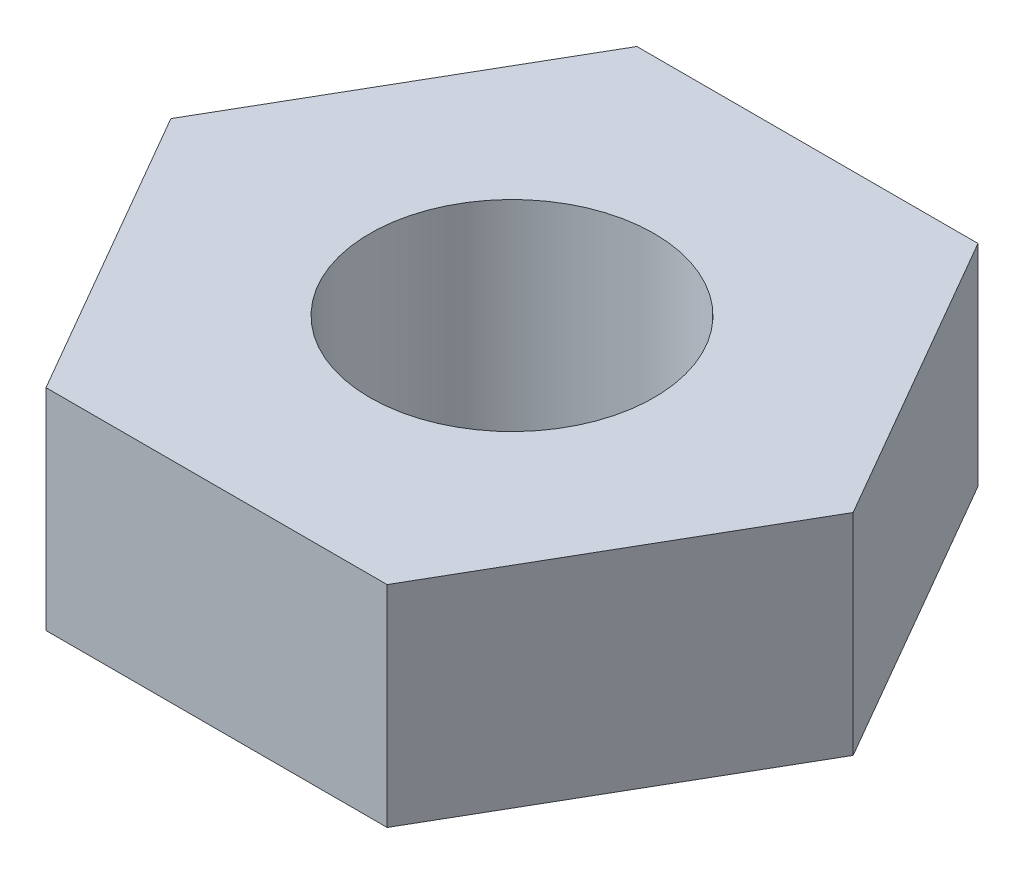
ISO-10303-21;
HEADER;
FILE_DESCRIPTION(('STEP AP214'),'2;1');
FILE_NAME('part.step','',(''),(''),'','','');
FILE_SCHEMA(('AUTOMOTIVE_DESIGN { 1 0 10303 214 1 1 1 1 }'));
ENDSEC;
DATA;
#1=APPLICATION_CONTEXT('core data for automotive mechanical design processes');
#2=APPLICATION_PROTOCOL_DEFINITION('international standard','automotive_design',2000,#1);
#3=PRODUCT_CONTEXT('',#1,'mechanical');
#4=PRODUCT('Part','Part','',(#3));
#5=PRODUCT_RELATED_PRODUCT_CATEGORY('part','',(#4));
#6=PRODUCT_DEFINITION_FORMATION('','',#4);
#7=PRODUCT_DEFINITION_CONTEXT('part definition',#1,'design');
#8=PRODUCT_DEFINITION('design','',#6,#7);
#9=PRODUCT_DEFINITION_SHAPE('','',#8);
#10=(LENGTH_UNIT() NAMED_UNIT(*) SI_UNIT(.MILLI.,.METRE.));
#11=(NAMED_UNIT(*) PLANE_ANGLE_UNIT() SI_UNIT($,.RADIAN.));
#12=(NAMED_UNIT(*) SI_UNIT($,.STERADIAN.) SOLID_ANGLE_UNIT());
#13=UNCERTAINTY_MEASURE_WITH_UNIT(LENGTH_MEASURE(1.E-05),#10,'distance_accuracy_value','');
#14=(GEOMETRIC_REPRESENTATION_CONTEXT(3) GLOBAL_UNCERTAINTY_ASSIGNED_CONTEXT((#13)) GLOBAL_UNIT_ASSIGNED_CONTEXT((#10,
#11,#12)) REPRESENTATION_CONTEXT('',''));
#15=CARTESIAN_POINT('',(0.,0.,0.));
#16=DIRECTION('',(0.,0.,1.));
#17=DIRECTION('',(1.,0.,0.));
#18=AXIS2_PLACEMENT_3D('',#15,#16,#17);
#19=CARTESIAN_POINT('',(1.50000000000003,1.85,2.59807621135329));
#20=DIRECTION('',(-0.866025403784442,0.,-0.499999999999995));
#21=DIRECTION('',(-0.499999999999995,0.,0.866025403784442));
#22=AXIS2_PLACEMENT_3D('',#19,#20,#21);
#23=PLANE('',#22);
#24=DIRECTION('',(0.499999999999995,0.,-0.866025403784442));
#25=VECTOR('',#24,1.);
#26=CARTESIAN_POINT('',(1.50000000000003,0.,2.59807621135329));
#27=LINE('',#26,#25);
#28=CARTESIAN_POINT('',(1.50000000000003,0.,2.59807621135329));
#29=VERTEX_POINT('',#28);
#30=CARTESIAN_POINT('',(2.99999999999999,0.,0.));
#31=VERTEX_POINT('',#30);
#32=EDGE_CURVE('E118',#29,#31,#27,.T.);
#33=ORIENTED_EDGE('',*,*,#32,.T.);
#34=DIRECTION('',(0.,-1.,0.));
#35=VECTOR('',#34,1.);
#36=CARTESIAN_POINT('',(2.99999999999999,1.85,0.));
#37=LINE('',#36,#35);
#38=CARTESIAN_POINT('',(2.99999999999999,1.85,0.));
#39=VERTEX_POINT('',#38);
#40=EDGE_CURVE('E11',#39,#31,#37,.T.);
#41=ORIENTED_EDGE('',*,*,#40,.F.);
#42=DIRECTION('',(0.499999999999995,0.,-0.866025403784442));
#43=VECTOR('',#42,1.);
#44=CARTESIAN_POINT('',(1.50000000000003,1.85,2.59807621135329));
#45=LINE('',#44,#43);
#46=CARTESIAN_POINT('',(1.50000000000003,1.85,2.59807621135329));
#47=VERTEX_POINT('',#46);
#48=EDGE_CURVE('E129',#47,#39,#45,.T.);
#49=ORIENTED_EDGE('',*,*,#48,.F.);
#50=DIRECTION('',(0.,-1.,0.));
#51=VECTOR('',#50,1.);
#52=CARTESIAN_POINT('',(1.50000000000003,1.85,2.59807621135329));
#53=LINE('',#52,#51);
#54=EDGE_CURVE('E114',#47,#29,#53,.T.);
#55=ORIENTED_EDGE('',*,*,#54,.T.);
#56=EDGE_LOOP('',(#33,#41,#49,#55));
#57=FACE_BOUND('',#56,.T.);
#58=ADVANCED_FACE('F34',(#57),#23,.F.);
#59=CARTESIAN_POINT('',(2.99999999999999,1.85,0.));
#60=DIRECTION('',(-0.866025403784438,0.,0.500000000000001));
#61=DIRECTION('',(0.500000000000001,0.,0.866025403784438));
#62=AXIS2_PLACEMENT_3D('',#59,#60,#61);
#63=PLANE('',#62);
#64=DIRECTION('',(-0.500000000000001,0.,-0.866025403784438));
#65=VECTOR('',#64,1.);
#66=CARTESIAN_POINT('',(2.99999999999999,0.,0.));
#67=LINE('',#66,#65);
#68=CARTESIAN_POINT('',(1.49999999999999,0.,-2.59807621135331));
#69=VERTEX_POINT('',#68);
#70=EDGE_CURVE('E121',#31,#69,#67,.T.);
#71=ORIENTED_EDGE('',*,*,#70,.T.);
#72=DIRECTION('',(0.,-1.,0.));
#73=VECTOR('',#72,1.);
#74=CARTESIAN_POINT('',(1.49999999999999,1.85,-2.59807621135331));
#75=LINE('',#74,#73);
#76=CARTESIAN_POINT('',(1.49999999999999,1.85,-2.59807621135331));
#77=VERTEX_POINT('',#76);
#78=EDGE_CURVE('E42',#77,#69,#75,.T.);
#79=ORIENTED_EDGE('',*,*,#78,.F.);
#80=DIRECTION('',(-0.500000000000001,0.,-0.866025403784438));
#81=VECTOR('',#80,1.);
#82=CARTESIAN_POINT('',(2.99999999999999,1.85,0.));
#83=LINE('',#82,#81);
#84=EDGE_CURVE('E87',#39,#77,#83,.T.);
#85=ORIENTED_EDGE('',*,*,#84,.F.);
#86=ORIENTED_EDGE('',*,*,#40,.T.);
#87=EDGE_LOOP('',(#71,#79,#85,#86));
#88=FACE_BOUND('',#87,.T.);
#89=ADVANCED_FACE('F154',(#88),#63,.F.);
#90=CARTESIAN_POINT('',(1.49999999999999,1.85,-2.59807621135331));
#91=DIRECTION('',(0.,0.,1.));
#92=DIRECTION('',(1.,0.,0.));
#93=AXIS2_PLACEMENT_3D('',#90,#91,#92);
#94=PLANE('',#93);
#95=DIRECTION('',(-1.,0.,0.));
#96=VECTOR('',#95,1.);
#97=CARTESIAN_POINT('',(1.49999999999999,0.,-2.59807621135331));
#98=LINE('',#97,#96);
#99=CARTESIAN_POINT('',(-1.50000000000001,0.,-2.5980762113533));
#100=VERTEX_POINT('',#99);
#101=EDGE_CURVE('E124',#69,#100,#98,.T.);
#102=ORIENTED_EDGE('',*,*,#101,.T.);
#103=DIRECTION('',(0.,-1.,0.));
#104=VECTOR('',#103,1.);
#105=CARTESIAN_POINT('',(-1.50000000000001,1.85,-2.5980762113533));
#106=LINE('',#105,#104);
#107=CARTESIAN_POINT('',(-1.50000000000001,1.85,-2.5980762113533));
#108=VERTEX_POINT('',#107);
#109=EDGE_CURVE('E109',#108,#100,#106,.T.);
#110=ORIENTED_EDGE('',*,*,#109,.F.);
#111=DIRECTION('',(-1.,0.,0.));
#112=VECTOR('',#111,1.);
#113=CARTESIAN_POINT('',(1.49999999999999,1.85,-2.59807621135331));
#114=LINE('',#113,#112);
#115=EDGE_CURVE('E100',#77,#108,#114,.T.);
#116=ORIENTED_EDGE('',*,*,#115,.F.);
#117=ORIENTED_EDGE('',*,*,#78,.T.);
#118=EDGE_LOOP('',(#102,#110,#116,#117));
#119=FACE_BOUND('',#118,.T.);
#120=ADVANCED_FACE('F135',(#119),#94,.F.);
#121=CARTESIAN_POINT('',(-1.50000000000001,1.85,-2.5980762113533));
#122=DIRECTION('',(0.866025403784442,0.,0.499999999999995));
#123=DIRECTION('',(0.499999999999995,0.,-0.866025403784442));
#124=AXIS2_PLACEMENT_3D('',#121,#122,#123);
#125=PLANE('',#124);
#126=DIRECTION('',(-0.499999999999995,0.,0.866025403784441));
#127=VECTOR('',#126,1.);
#128=CARTESIAN_POINT('',(-1.50000000000001,0.,-2.5980762113533));
#129=LINE('',#128,#127);
#130=CARTESIAN_POINT('',(-2.99999999999999,0.,0.));
#131=VERTEX_POINT('',#130);
#132=EDGE_CURVE('E108',#100,#131,#129,.T.);
#133=ORIENTED_EDGE('',*,*,#132,.T.);
#134=DIRECTION('',(0.,-1.,0.));
#135=VECTOR('',#134,1.);
#136=CARTESIAN_POINT('',(-2.99999999999999,1.85,0.));
#137=LINE('',#136,#135);
#138=CARTESIAN_POINT('',(-2.99999999999999,1.85,0.));
#139=VERTEX_POINT('',#138);
#140=EDGE_CURVE('E105',#139,#131,#137,.T.);
#141=ORIENTED_EDGE('',*,*,#140,.F.);
#142=DIRECTION('',(-0.499999999999995,0.,0.866025403784441));
#143=VECTOR('',#142,1.);
#144=CARTESIAN_POINT('',(-1.50000000000001,1.85,-2.5980762113533));
#145=LINE('',#144,#143);
#146=EDGE_CURVE('E94',#108,#139,#145,.T.);
#147=ORIENTED_EDGE('',*,*,#146,.F.);
#148=ORIENTED_EDGE('',*,*,#109,.T.);
#149=EDGE_LOOP('',(#133,#141,#147,#148));
#150=FACE_BOUND('',#149,.T.);
#151=ADVANCED_FACE('F106',(#150),#125,.F.);
#152=CARTESIAN_POINT('',(-2.99999999999999,1.85,0.));
#153=DIRECTION('',(0.866025403784435,0.,-0.500000000000007));
#154=DIRECTION('',(-0.500000000000007,0.,-0.866025403784435));
#155=AXIS2_PLACEMENT_3D('',#152,#153,#154);
#156=PLANE('',#155);
#157=DIRECTION('',(0.500000000000007,0.,0.866025403784435));
#158=VECTOR('',#157,1.);
#159=CARTESIAN_POINT('',(-2.99999999999999,0.,0.));
#160=LINE('',#159,#158);
#161=CARTESIAN_POINT('',(-1.49999999999997,0.,2.59807621135332));
#162=VERTEX_POINT('',#161);
#163=EDGE_CURVE('E73',#131,#162,#160,.T.);
#164=ORIENTED_EDGE('',*,*,#163,.T.);
#165=DIRECTION('',(0.,-1.,0.));
#166=VECTOR('',#165,1.);
#167=CARTESIAN_POINT('',(-1.49999999999997,1.85,2.59807621135332));
#168=LINE('',#167,#166);
#169=CARTESIAN_POINT('',(-1.49999999999997,1.85,2.59807621135332));
#170=VERTEX_POINT('',#169);
#171=EDGE_CURVE('E110',#170,#162,#168,.T.);
#172=ORIENTED_EDGE('',*,*,#171,.F.);
#173=DIRECTION('',(0.500000000000007,0.,0.866025403784435));
#174=VECTOR('',#173,1.);
#175=CARTESIAN_POINT('',(-2.99999999999999,1.85,0.));
#176=LINE('',#175,#174);
#177=EDGE_CURVE('E98',#139,#170,#176,.T.);
#178=ORIENTED_EDGE('',*,*,#177,.F.);
#179=ORIENTED_EDGE('',*,*,#140,.T.);
#180=EDGE_LOOP('',(#164,#172,#178,#179));
#181=FACE_BOUND('',#180,.T.);
#182=ADVANCED_FACE('F112',(#181),#156,.F.);
#183=CARTESIAN_POINT('',(-1.49999999999997,1.85,2.59807621135332));
#184=DIRECTION('',(0.,0.,-1.));
#185=DIRECTION('',(-1.,0.,0.));
#186=AXIS2_PLACEMENT_3D('',#183,#184,#185);
#187=PLANE('',#186);
#188=DIRECTION('',(1.,0.,0.));
#189=VECTOR('',#188,1.);
#190=CARTESIAN_POINT('',(-1.49999999999997,0.,2.59807621135332));
#191=LINE('',#190,#189);
#192=EDGE_CURVE('E79',#162,#29,#191,.T.);
#193=ORIENTED_EDGE('',*,*,#192,.T.);
#194=ORIENTED_EDGE('',*,*,#54,.F.);
#195=DIRECTION('',(1.,0.,0.));
#196=VECTOR('',#195,1.);
#197=CARTESIAN_POINT('',(-1.49999999999997,1.85,2.59807621135332));
#198=LINE('',#197,#196);
#199=EDGE_CURVE('E50',#170,#47,#198,.T.);
#200=ORIENTED_EDGE('',*,*,#199,.F.);
#201=ORIENTED_EDGE('',*,*,#171,.T.);
#202=EDGE_LOOP('',(#193,#194,#200,#201));
#203=FACE_BOUND('',#202,.T.);
#204=ADVANCED_FACE('F142',(#203),#187,.F.);
#205=CARTESIAN_POINT('',(0.,1.85,0.));
#206=DIRECTION('',(0.,1.,0.));
#207=DIRECTION('',(0.,0.,1.));
#208=AXIS2_PLACEMENT_3D('',#205,#206,#207);
#209=PLANE('',#208);
#210=CARTESIAN_POINT('',(0.,1.85,0.));
#211=DIRECTION('',(0.,1.,0.));
#212=DIRECTION('',(0.,0.,1.));
#213=AXIS2_PLACEMENT_3D('',#210,#211,#212);
#214=CIRCLE('',#213,1.25);
#215=CARTESIAN_POINT('',(0.,1.85,1.25));
#216=VERTEX_POINT('',#215);
#217=EDGE_CURVE('E209',#216,#216,#214,.T.);
#218=ORIENTED_EDGE('',*,*,#217,.F.);
#219=EDGE_LOOP('',(#218));
#220=FACE_BOUND('',#219,.T.);
#221=ORIENTED_EDGE('',*,*,#48,.T.);
#222=ORIENTED_EDGE('',*,*,#84,.T.);
#223=ORIENTED_EDGE('',*,*,#115,.T.);
#224=ORIENTED_EDGE('',*,*,#146,.T.);
#225=ORIENTED_EDGE('',*,*,#177,.T.);
#226=ORIENTED_EDGE('',*,*,#199,.T.);
#227=EDGE_LOOP('',(#221,#222,#223,#224,#225,#226));
#228=FACE_BOUND('',#227,.T.);
#229=ADVANCED_FACE('F96',(#220,#228),#209,.T.);
#230=CARTESIAN_POINT('',(0.,0.,0.));
#231=DIRECTION('',(0.,1.,0.));
#232=DIRECTION('',(0.,0.,1.));
#233=AXIS2_PLACEMENT_3D('',#230,#231,#232);
#234=PLANE('',#233);
#235=CARTESIAN_POINT('',(0.,0.,0.));
#236=DIRECTION('',(0.,1.,0.));
#237=DIRECTION('',(0.,0.,1.));
#238=AXIS2_PLACEMENT_3D('',#235,#236,#237);
#239=CIRCLE('',#238,1.25);
#240=CARTESIAN_POINT('',(0.,0.,1.25));
#241=VERTEX_POINT('',#240);
#242=EDGE_CURVE('E122',#241,#241,#239,.T.);
#243=ORIENTED_EDGE('',*,*,#242,.T.);
#244=EDGE_LOOP('',(#243));
#245=FACE_BOUND('',#244,.T.);
#246=ORIENTED_EDGE('',*,*,#32,.F.);
#247=ORIENTED_EDGE('',*,*,#192,.F.);
#248=ORIENTED_EDGE('',*,*,#163,.F.);
#249=ORIENTED_EDGE('',*,*,#132,.F.);
#250=ORIENTED_EDGE('',*,*,#101,.F.);
#251=ORIENTED_EDGE('',*,*,#70,.F.);
#252=EDGE_LOOP('',(#246,#247,#248,#249,#250,#251));
#253=FACE_BOUND('',#252,.T.);
#254=ADVANCED_FACE('F138',(#245,#253),#234,.F.);
#255=CARTESIAN_POINT('',(0.,0.,0.));
#256=DIRECTION('',(0.,1.,0.));
#257=DIRECTION('',(0.,0.,1.));
#258=AXIS2_PLACEMENT_3D('',#255,#256,#257);
#259=CYLINDRICAL_SURFACE('',#258,1.25);
#260=ORIENTED_EDGE('',*,*,#242,.F.);
#261=EDGE_LOOP('',(#260));
#262=FACE_BOUND('',#261,.T.);
#263=ORIENTED_EDGE('',*,*,#217,.T.);
#264=EDGE_LOOP('',(#263));
#265=FACE_BOUND('',#264,.T.);
#266=ADVANCED_FACE('F191',(#262,#265),#259,.F.);
#267=CLOSED_SHELL('',(#58,#89,#120,#151,#182,#204,#229,#254,#266));
#268=MANIFOLD_SOLID_BREP('B2',#267);
#269=ADVANCED_BREP_SHAPE_REPRESENTATION('',(#18,#268),#14);
#270=SHAPE_DEFINITION_REPRESENTATION(#9,#269);
ENDSEC;
END-ISO-10303-21;
